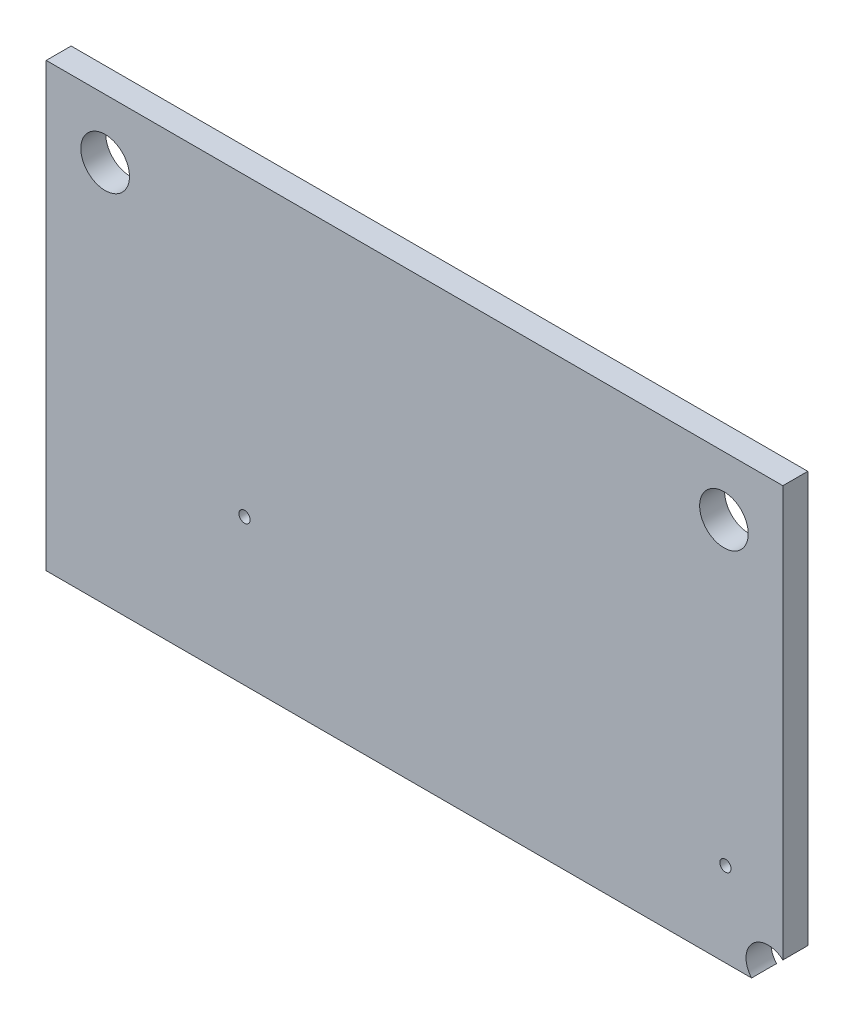
ISO-10303-21;
HEADER;
FILE_DESCRIPTION(('STEP AP214'),'2;1');
FILE_NAME('part.step','',(''),(''),'','','');
FILE_SCHEMA(('AUTOMOTIVE_DESIGN { 1 0 10303 214 1 1 1 1 }'));
ENDSEC;
DATA;
#1=APPLICATION_CONTEXT('core data for automotive mechanical design processes');
#2=APPLICATION_PROTOCOL_DEFINITION('international standard','automotive_design',2000,#1);
#3=PRODUCT_CONTEXT('',#1,'mechanical');
#4=PRODUCT('Part','Part','',(#3));
#5=PRODUCT_RELATED_PRODUCT_CATEGORY('part','',(#4));
#6=PRODUCT_DEFINITION_FORMATION('','',#4);
#7=PRODUCT_DEFINITION_CONTEXT('part definition',#1,'design');
#8=PRODUCT_DEFINITION('design','',#6,#7);
#9=PRODUCT_DEFINITION_SHAPE('','',#8);
#10=(LENGTH_UNIT() NAMED_UNIT(*) SI_UNIT(.MILLI.,.METRE.));
#11=(NAMED_UNIT(*) PLANE_ANGLE_UNIT() SI_UNIT($,.RADIAN.));
#12=(NAMED_UNIT(*) SI_UNIT($,.STERADIAN.) SOLID_ANGLE_UNIT());
#13=UNCERTAINTY_MEASURE_WITH_UNIT(LENGTH_MEASURE(1.E-05),#10,'distance_accuracy_value','');
#14=(GEOMETRIC_REPRESENTATION_CONTEXT(3) GLOBAL_UNCERTAINTY_ASSIGNED_CONTEXT((#13)) GLOBAL_UNIT_ASSIGNED_CONTEXT((#10,
#11,#12)) REPRESENTATION_CONTEXT('',''));
#15=CARTESIAN_POINT('',(0.,0.,0.));
#16=DIRECTION('',(0.,0.,1.));
#17=DIRECTION('',(1.,0.,0.));
#18=AXIS2_PLACEMENT_3D('',#15,#16,#17);
#19=CARTESIAN_POINT('',(0.,0.,0.));
#20=DIRECTION('',(-1.,0.,0.));
#21=DIRECTION('',(0.,1.,0.));
#22=AXIS2_PLACEMENT_3D('',#19,#20,#21);
#23=PLANE('',#22);
#24=DIRECTION('',(0.,0.,1.));
#25=VECTOR('',#24,1.);
#26=CARTESIAN_POINT('',(0.,0.,0.));
#27=LINE('',#26,#25);
#28=CARTESIAN_POINT('',(0.,0.,0.));
#29=VERTEX_POINT('',#28);
#30=CARTESIAN_POINT('',(0.,0.,1.69143934));
#31=VERTEX_POINT('',#30);
#32=EDGE_CURVE('E10',#29,#31,#27,.T.);
#33=ORIENTED_EDGE('',*,*,#32,.T.);
#34=DIRECTION('',(0.,1.,0.));
#35=VECTOR('',#34,1.);
#36=CARTESIAN_POINT('',(0.,0.,1.69143934));
#37=LINE('',#36,#35);
#38=CARTESIAN_POINT('',(0.,30.,1.69143934));
#39=VERTEX_POINT('',#38);
#40=EDGE_CURVE('E23',#31,#39,#37,.T.);
#41=ORIENTED_EDGE('',*,*,#40,.T.);
#42=DIRECTION('',(0.,0.,1.));
#43=VECTOR('',#42,1.);
#44=CARTESIAN_POINT('',(0.,30.,0.));
#45=LINE('',#44,#43);
#46=CARTESIAN_POINT('',(0.,30.,0.));
#47=VERTEX_POINT('',#46);
#48=EDGE_CURVE('E152',#47,#39,#45,.T.);
#49=ORIENTED_EDGE('',*,*,#48,.F.);
#50=DIRECTION('',(0.,1.,0.));
#51=VECTOR('',#50,1.);
#52=CARTESIAN_POINT('',(0.,0.,0.));
#53=LINE('',#52,#51);
#54=EDGE_CURVE('E149',#29,#47,#53,.T.);
#55=ORIENTED_EDGE('',*,*,#54,.F.);
#56=EDGE_LOOP('',(#33,#41,#49,#55));
#57=FACE_BOUND('',#56,.T.);
#58=ADVANCED_FACE('F16',(#57),#23,.T.);
#59=CARTESIAN_POINT('',(0.,30.,0.));
#60=DIRECTION('',(0.,1.,0.));
#61=DIRECTION('',(1.,0.,0.));
#62=AXIS2_PLACEMENT_3D('',#59,#60,#61);
#63=PLANE('',#62);
#64=ORIENTED_EDGE('',*,*,#48,.T.);
#65=DIRECTION('',(1.,0.,0.));
#66=VECTOR('',#65,1.);
#67=CARTESIAN_POINT('',(0.,30.,1.69143934));
#68=LINE('',#67,#66);
#69=CARTESIAN_POINT('',(50.,30.,1.69143934));
#70=VERTEX_POINT('',#69);
#71=EDGE_CURVE('E146',#39,#70,#68,.T.);
#72=ORIENTED_EDGE('',*,*,#71,.T.);
#73=DIRECTION('',(0.,0.,1.));
#74=VECTOR('',#73,1.);
#75=CARTESIAN_POINT('',(50.,30.,0.));
#76=LINE('',#75,#74);
#77=CARTESIAN_POINT('',(50.,30.,0.));
#78=VERTEX_POINT('',#77);
#79=EDGE_CURVE('E144',#78,#70,#76,.T.);
#80=ORIENTED_EDGE('',*,*,#79,.F.);
#81=DIRECTION('',(1.,0.,0.));
#82=VECTOR('',#81,1.);
#83=CARTESIAN_POINT('',(0.,30.,0.));
#84=LINE('',#83,#82);
#85=EDGE_CURVE('E141',#47,#78,#84,.T.);
#86=ORIENTED_EDGE('',*,*,#85,.F.);
#87=EDGE_LOOP('',(#64,#72,#80,#86));
#88=FACE_BOUND('',#87,.T.);
#89=ADVANCED_FACE('F161',(#88),#63,.T.);
#90=CARTESIAN_POINT('',(50.,30.,0.));
#91=DIRECTION('',(1.,0.,0.));
#92=DIRECTION('',(0.,-1.,0.));
#93=AXIS2_PLACEMENT_3D('',#90,#91,#92);
#94=PLANE('',#93);
#95=ORIENTED_EDGE('',*,*,#79,.T.);
#96=DIRECTION('',(0.,-1.,0.));
#97=VECTOR('',#96,1.);
#98=CARTESIAN_POINT('',(50.,30.,1.69143934));
#99=LINE('',#98,#97);
#100=CARTESIAN_POINT('',(50.,2.11800003051758,1.69143934));
#101=VERTEX_POINT('',#100);
#102=EDGE_CURVE('E138',#70,#101,#99,.T.);
#103=ORIENTED_EDGE('',*,*,#102,.T.);
#104=DIRECTION('',(0.,0.,1.));
#105=VECTOR('',#104,1.);
#106=CARTESIAN_POINT('',(50.,2.11800003051758,0.));
#107=LINE('',#106,#105);
#108=CARTESIAN_POINT('',(50.,2.11800003051758,0.));
#109=VERTEX_POINT('',#108);
#110=EDGE_CURVE('E136',#109,#101,#107,.T.);
#111=ORIENTED_EDGE('',*,*,#110,.F.);
#112=DIRECTION('',(0.,-1.,0.));
#113=VECTOR('',#112,1.);
#114=CARTESIAN_POINT('',(50.,30.,0.));
#115=LINE('',#114,#113);
#116=EDGE_CURVE('E133',#78,#109,#115,.T.);
#117=ORIENTED_EDGE('',*,*,#116,.F.);
#118=EDGE_LOOP('',(#95,#103,#111,#117));
#119=FACE_BOUND('',#118,.T.);
#120=ADVANCED_FACE('F168',(#119),#94,.T.);
#121=CARTESIAN_POINT('',(49.0002209379696,0.997132789843579,0.));
#122=DIRECTION('',(0.,0.,-1.));
#123=DIRECTION('',(0.665646980807757,0.746266773306649,0.));
#124=AXIS2_PLACEMENT_3D('',#121,#122,#123);
#125=CYLINDRICAL_SURFACE('',#124,1.50196589311826);
#126=ORIENTED_EDGE('',*,*,#110,.T.);
#127=CARTESIAN_POINT('',(49.0002209379696,0.997132789843579,1.69143934));
#128=DIRECTION('',(0.,0.,1.));
#129=DIRECTION('',(0.665646980807757,0.746266773306649,0.));
#130=AXIS2_PLACEMENT_3D('',#127,#128,#129);
#131=CIRCLE('',#130,1.50196589311826);
#132=CARTESIAN_POINT('',(47.8769989013672,0.,1.69143934));
#133=VERTEX_POINT('',#132);
#134=EDGE_CURVE('E130',#101,#133,#131,.T.);
#135=ORIENTED_EDGE('',*,*,#134,.T.);
#136=DIRECTION('',(0.,0.,1.));
#137=VECTOR('',#136,1.);
#138=CARTESIAN_POINT('',(47.8769989013672,0.,0.));
#139=LINE('',#138,#137);
#140=CARTESIAN_POINT('',(47.8769989013672,0.,0.));
#141=VERTEX_POINT('',#140);
#142=EDGE_CURVE('E128',#141,#133,#139,.T.);
#143=ORIENTED_EDGE('',*,*,#142,.F.);
#144=CARTESIAN_POINT('',(49.0002209379696,0.997132789843579,0.));
#145=DIRECTION('',(0.,0.,1.));
#146=DIRECTION('',(0.665646980807757,0.746266773306649,0.));
#147=AXIS2_PLACEMENT_3D('',#144,#145,#146);
#148=CIRCLE('',#147,1.50196589311826);
#149=EDGE_CURVE('E125',#109,#141,#148,.T.);
#150=ORIENTED_EDGE('',*,*,#149,.F.);
#151=EDGE_LOOP('',(#126,#135,#143,#150));
#152=FACE_BOUND('',#151,.T.);
#153=ADVANCED_FACE('F170',(#152),#125,.F.);
#154=CARTESIAN_POINT('',(47.8769989013672,0.,0.));
#155=DIRECTION('',(0.,-1.,0.));
#156=DIRECTION('',(-1.,0.,0.));
#157=AXIS2_PLACEMENT_3D('',#154,#155,#156);
#158=PLANE('',#157);
#159=ORIENTED_EDGE('',*,*,#142,.T.);
#160=DIRECTION('',(-1.,0.,0.));
#161=VECTOR('',#160,1.);
#162=CARTESIAN_POINT('',(47.8769989013672,0.,1.69143934));
#163=LINE('',#162,#161);
#164=EDGE_CURVE('E123',#133,#31,#163,.T.);
#165=ORIENTED_EDGE('',*,*,#164,.T.);
#166=ORIENTED_EDGE('',*,*,#32,.F.);
#167=DIRECTION('',(-1.,0.,0.));
#168=VECTOR('',#167,1.);
#169=CARTESIAN_POINT('',(47.8769989013672,0.,0.));
#170=LINE('',#169,#168);
#171=EDGE_CURVE('E120',#141,#29,#170,.T.);
#172=ORIENTED_EDGE('',*,*,#171,.F.);
#173=EDGE_LOOP('',(#159,#165,#166,#172));
#174=FACE_BOUND('',#173,.T.);
#175=ADVANCED_FACE('F171',(#174),#158,.T.);
#176=CARTESIAN_POINT('',(13.462,9.906,0.));
#177=DIRECTION('',(0.,0.,-1.));
#178=DIRECTION('',(1.,0.,0.));
#179=AXIS2_PLACEMENT_3D('',#176,#177,#178);
#180=CYLINDRICAL_SURFACE('',#179,0.381);
#181=DIRECTION('',(0.,0.,1.));
#182=VECTOR('',#181,1.);
#183=CARTESIAN_POINT('',(13.843,9.906,0.));
#184=LINE('',#183,#182);
#185=CARTESIAN_POINT('',(13.843,9.906,0.));
#186=VERTEX_POINT('',#185);
#187=CARTESIAN_POINT('',(13.843,9.906,1.69143934));
#188=VERTEX_POINT('',#187);
#189=EDGE_CURVE('E118',#186,#188,#184,.T.);
#190=ORIENTED_EDGE('',*,*,#189,.T.);
#191=CARTESIAN_POINT('',(13.462,9.906,1.69143934));
#192=DIRECTION('',(0.,0.,1.));
#193=DIRECTION('',(1.,0.,0.));
#194=AXIS2_PLACEMENT_3D('',#191,#192,#193);
#195=CIRCLE('',#194,0.381);
#196=EDGE_CURVE('E115',#188,#188,#195,.T.);
#197=ORIENTED_EDGE('',*,*,#196,.T.);
#198=ORIENTED_EDGE('',*,*,#189,.F.);
#199=CARTESIAN_POINT('',(13.462,9.906,0.));
#200=DIRECTION('',(0.,0.,1.));
#201=DIRECTION('',(1.,0.,0.));
#202=AXIS2_PLACEMENT_3D('',#199,#200,#201);
#203=CIRCLE('',#202,0.381);
#204=EDGE_CURVE('E112',#186,#186,#203,.T.);
#205=ORIENTED_EDGE('',*,*,#204,.F.);
#206=EDGE_LOOP('',(#190,#197,#198,#205));
#207=FACE_BOUND('',#206,.T.);
#208=ADVANCED_FACE('F173',(#207),#180,.F.);
#209=CARTESIAN_POINT('',(3.99999962,25.9999988,0.));
#210=DIRECTION('',(0.,0.,-1.));
#211=DIRECTION('',(1.,0.,0.));
#212=AXIS2_PLACEMENT_3D('',#209,#210,#211);
#213=CYLINDRICAL_SURFACE('',#212,1.64999924);
#214=DIRECTION('',(0.,0.,1.));
#215=VECTOR('',#214,1.);
#216=CARTESIAN_POINT('',(5.64999886,25.9999988,0.));
#217=LINE('',#216,#215);
#218=CARTESIAN_POINT('',(5.64999886,25.9999988,0.));
#219=VERTEX_POINT('',#218);
#220=CARTESIAN_POINT('',(5.64999886,25.9999988,1.69143934));
#221=VERTEX_POINT('',#220);
#222=EDGE_CURVE('E110',#219,#221,#217,.T.);
#223=ORIENTED_EDGE('',*,*,#222,.T.);
#224=CARTESIAN_POINT('',(3.99999962,25.9999988,1.69143934));
#225=DIRECTION('',(0.,0.,1.));
#226=DIRECTION('',(1.,0.,0.));
#227=AXIS2_PLACEMENT_3D('',#224,#225,#226);
#228=CIRCLE('',#227,1.64999924);
#229=EDGE_CURVE('E107',#221,#221,#228,.T.);
#230=ORIENTED_EDGE('',*,*,#229,.T.);
#231=ORIENTED_EDGE('',*,*,#222,.F.);
#232=CARTESIAN_POINT('',(3.99999962,25.9999988,0.));
#233=DIRECTION('',(0.,0.,1.));
#234=DIRECTION('',(1.,0.,0.));
#235=AXIS2_PLACEMENT_3D('',#232,#233,#234);
#236=CIRCLE('',#235,1.64999924);
#237=EDGE_CURVE('E104',#219,#219,#236,.T.);
#238=ORIENTED_EDGE('',*,*,#237,.F.);
#239=EDGE_LOOP('',(#223,#230,#231,#238));
#240=FACE_BOUND('',#239,.T.);
#241=ADVANCED_FACE('F180',(#240),#213,.F.);
#242=CARTESIAN_POINT('',(46.101,5.715,0.));
#243=DIRECTION('',(0.,0.,-1.));
#244=DIRECTION('',(1.,0.,0.));
#245=AXIS2_PLACEMENT_3D('',#242,#243,#244);
#246=CYLINDRICAL_SURFACE('',#245,0.381);
#247=DIRECTION('',(0.,0.,1.));
#248=VECTOR('',#247,1.);
#249=CARTESIAN_POINT('',(46.482,5.715,0.));
#250=LINE('',#249,#248);
#251=CARTESIAN_POINT('',(46.482,5.715,0.));
#252=VERTEX_POINT('',#251);
#253=CARTESIAN_POINT('',(46.482,5.715,1.69143934));
#254=VERTEX_POINT('',#253);
#255=EDGE_CURVE('E102',#252,#254,#250,.T.);
#256=ORIENTED_EDGE('',*,*,#255,.T.);
#257=CARTESIAN_POINT('',(46.101,5.715,1.69143934));
#258=DIRECTION('',(0.,0.,1.));
#259=DIRECTION('',(1.,0.,0.));
#260=AXIS2_PLACEMENT_3D('',#257,#258,#259);
#261=CIRCLE('',#260,0.381);
#262=EDGE_CURVE('E99',#254,#254,#261,.T.);
#263=ORIENTED_EDGE('',*,*,#262,.T.);
#264=ORIENTED_EDGE('',*,*,#255,.F.);
#265=CARTESIAN_POINT('',(46.101,5.715,0.));
#266=DIRECTION('',(0.,0.,1.));
#267=DIRECTION('',(1.,0.,0.));
#268=AXIS2_PLACEMENT_3D('',#265,#266,#267);
#269=CIRCLE('',#268,0.381);
#270=EDGE_CURVE('E90',#252,#252,#269,.T.);
#271=ORIENTED_EDGE('',*,*,#270,.F.);
#272=EDGE_LOOP('',(#256,#263,#264,#271));
#273=FACE_BOUND('',#272,.T.);
#274=ADVANCED_FACE('F225',(#273),#246,.F.);
#275=CARTESIAN_POINT('',(45.99999944,25.9999988,0.));
#276=DIRECTION('',(0.,0.,-1.));
#277=DIRECTION('',(1.,0.,0.));
#278=AXIS2_PLACEMENT_3D('',#275,#276,#277);
#279=CYLINDRICAL_SURFACE('',#278,1.64999924);
#280=DIRECTION('',(0.,0.,1.));
#281=VECTOR('',#280,1.);
#282=CARTESIAN_POINT('',(47.64999868,25.9999988,0.));
#283=LINE('',#282,#281);
#284=CARTESIAN_POINT('',(47.64999868,25.9999988,0.));
#285=VERTEX_POINT('',#284);
#286=CARTESIAN_POINT('',(47.64999868,25.9999988,1.69143934));
#287=VERTEX_POINT('',#286);
#288=EDGE_CURVE('E84',#285,#287,#283,.T.);
#289=ORIENTED_EDGE('',*,*,#288,.T.);
#290=CARTESIAN_POINT('',(45.99999944,25.9999988,1.69143934));
#291=DIRECTION('',(0.,0.,1.));
#292=DIRECTION('',(1.,0.,0.));
#293=AXIS2_PLACEMENT_3D('',#290,#291,#292);
#294=CIRCLE('',#293,1.64999924);
#295=EDGE_CURVE('E89',#287,#287,#294,.T.);
#296=ORIENTED_EDGE('',*,*,#295,.T.);
#297=ORIENTED_EDGE('',*,*,#288,.F.);
#298=CARTESIAN_POINT('',(45.99999944,25.9999988,0.));
#299=DIRECTION('',(0.,0.,1.));
#300=DIRECTION('',(1.,0.,0.));
#301=AXIS2_PLACEMENT_3D('',#298,#299,#300);
#302=CIRCLE('',#301,1.64999924);
#303=EDGE_CURVE('E87',#285,#285,#302,.T.);
#304=ORIENTED_EDGE('',*,*,#303,.F.);
#305=EDGE_LOOP('',(#289,#296,#297,#304));
#306=FACE_BOUND('',#305,.T.);
#307=ADVANCED_FACE('F86',(#306),#279,.F.);
#308=CARTESIAN_POINT('',(0.,0.,0.));
#309=DIRECTION('',(0.,0.,1.));
#310=DIRECTION('',(1.,0.,0.));
#311=AXIS2_PLACEMENT_3D('',#308,#309,#310);
#312=PLANE('',#311);
#313=ORIENTED_EDGE('',*,*,#54,.T.);
#314=ORIENTED_EDGE('',*,*,#85,.T.);
#315=ORIENTED_EDGE('',*,*,#116,.T.);
#316=ORIENTED_EDGE('',*,*,#149,.T.);
#317=ORIENTED_EDGE('',*,*,#171,.T.);
#318=EDGE_LOOP('',(#313,#314,#315,#316,#317));
#319=FACE_BOUND('',#318,.T.);
#320=ORIENTED_EDGE('',*,*,#204,.T.);
#321=EDGE_LOOP('',(#320));
#322=FACE_BOUND('',#321,.T.);
#323=ORIENTED_EDGE('',*,*,#237,.T.);
#324=EDGE_LOOP('',(#323));
#325=FACE_BOUND('',#324,.T.);
#326=ORIENTED_EDGE('',*,*,#270,.T.);
#327=EDGE_LOOP('',(#326));
#328=FACE_BOUND('',#327,.T.);
#329=ORIENTED_EDGE('',*,*,#303,.T.);
#330=EDGE_LOOP('',(#329));
#331=FACE_BOUND('',#330,.T.);
#332=ADVANCED_FACE('F93',(#319,#322,#325,#328,#331),#312,.F.);
#333=CARTESIAN_POINT('',(0.,0.,1.69143934));
#334=DIRECTION('',(0.,0.,1.));
#335=DIRECTION('',(1.,0.,0.));
#336=AXIS2_PLACEMENT_3D('',#333,#334,#335);
#337=PLANE('',#336);
#338=ORIENTED_EDGE('',*,*,#164,.F.);
#339=ORIENTED_EDGE('',*,*,#134,.F.);
#340=ORIENTED_EDGE('',*,*,#102,.F.);
#341=ORIENTED_EDGE('',*,*,#71,.F.);
#342=ORIENTED_EDGE('',*,*,#40,.F.);
#343=EDGE_LOOP('',(#338,#339,#340,#341,#342));
#344=FACE_BOUND('',#343,.T.);
#345=ORIENTED_EDGE('',*,*,#196,.F.);
#346=EDGE_LOOP('',(#345));
#347=FACE_BOUND('',#346,.T.);
#348=ORIENTED_EDGE('',*,*,#229,.F.);
#349=EDGE_LOOP('',(#348));
#350=FACE_BOUND('',#349,.T.);
#351=ORIENTED_EDGE('',*,*,#262,.F.);
#352=EDGE_LOOP('',(#351));
#353=FACE_BOUND('',#352,.T.);
#354=ORIENTED_EDGE('',*,*,#295,.F.);
#355=EDGE_LOOP('',(#354));
#356=FACE_BOUND('',#355,.T.);
#357=ADVANCED_FACE('F157',(#344,#347,#350,#353,#356),#337,.T.);
#358=CLOSED_SHELL('',(#58,#89,#120,#153,#175,#208,#241,#274,#307,#332,#357));
#359=MANIFOLD_SOLID_BREP('B1',#358);
#360=ADVANCED_BREP_SHAPE_REPRESENTATION('',(#18,#359),#14);
#361=SHAPE_DEFINITION_REPRESENTATION(#9,#360);
ENDSEC;
END-ISO-10303-21;
